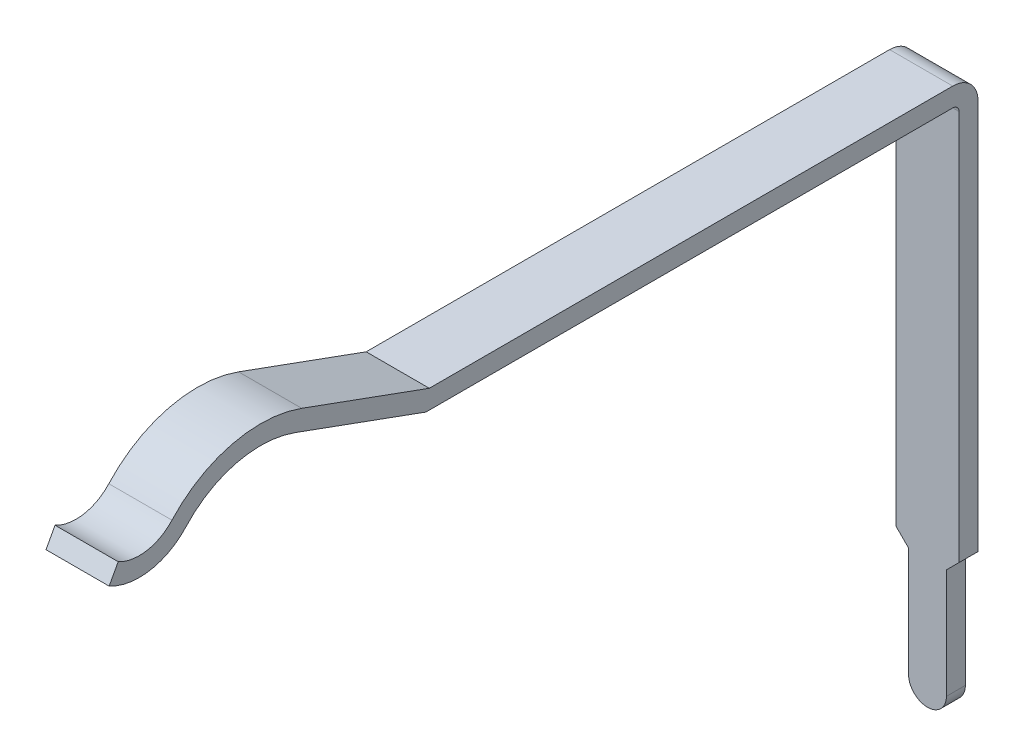
ISO-10303-21;
HEADER;
FILE_DESCRIPTION(('STEP AP214'),'2;1');
FILE_NAME('part.step','',(''),(''),'','','');
FILE_SCHEMA(('AUTOMOTIVE_DESIGN { 1 0 10303 214 1 1 1 1 }'));
ENDSEC;
DATA;
#1=APPLICATION_CONTEXT('core data for automotive mechanical design processes');
#2=APPLICATION_PROTOCOL_DEFINITION('international standard','automotive_design',2000,#1);
#3=PRODUCT_CONTEXT('',#1,'mechanical');
#4=PRODUCT('Part','Part','',(#3));
#5=PRODUCT_RELATED_PRODUCT_CATEGORY('part','',(#4));
#6=PRODUCT_DEFINITION_FORMATION('','',#4);
#7=PRODUCT_DEFINITION_CONTEXT('part definition',#1,'design');
#8=PRODUCT_DEFINITION('design','',#6,#7);
#9=PRODUCT_DEFINITION_SHAPE('','',#8);
#10=(LENGTH_UNIT() NAMED_UNIT(*) SI_UNIT(.MILLI.,.METRE.));
#11=(NAMED_UNIT(*) PLANE_ANGLE_UNIT() SI_UNIT($,.RADIAN.));
#12=(NAMED_UNIT(*) SI_UNIT($,.STERADIAN.) SOLID_ANGLE_UNIT());
#13=UNCERTAINTY_MEASURE_WITH_UNIT(LENGTH_MEASURE(1.E-05),#10,'distance_accuracy_value','');
#14=(GEOMETRIC_REPRESENTATION_CONTEXT(3) GLOBAL_UNCERTAINTY_ASSIGNED_CONTEXT((#13)) GLOBAL_UNIT_ASSIGNED_CONTEXT((#10,
#11,#12)) REPRESENTATION_CONTEXT('',''));
#15=CARTESIAN_POINT('',(0.,0.,0.));
#16=DIRECTION('',(0.,0.,1.));
#17=DIRECTION('',(1.,0.,0.));
#18=AXIS2_PLACEMENT_3D('',#15,#16,#17);
#19=CARTESIAN_POINT('',(0.5,-0.1,-14.46));
#20=DIRECTION('',(0.,0.,-1.));
#21=DIRECTION('',(-1.,0.,0.));
#22=AXIS2_PLACEMENT_3D('',#19,#20,#21);
#23=PLANE('',#22);
#24=DIRECTION('',(0.,1.,0.));
#25=VECTOR('',#24,1.);
#26=CARTESIAN_POINT('',(0.3,-0.1,-14.46));
#27=LINE('',#26,#25);
#28=CARTESIAN_POINT('',(0.3,-8.22,-14.46));
#29=VERTEX_POINT('',#28);
#30=CARTESIAN_POINT('',(0.3,-6.48526500902805,-14.46));
#31=VERTEX_POINT('',#30);
#32=EDGE_CURVE('E277',#29,#31,#27,.T.);
#33=ORIENTED_EDGE('',*,*,#32,.T.);
#34=DIRECTION('',(0.707106781186563,0.707106781186532,0.));
#35=VECTOR('',#34,1.);
#36=CARTESIAN_POINT('',(3.59263250451403,-3.19263250451416,-14.46));
#37=LINE('',#36,#35);
#38=CARTESIAN_POINT('',(0.5,-6.28526500902806,-14.46));
#39=VERTEX_POINT('',#38);
#40=EDGE_CURVE('E272',#31,#39,#37,.T.);
#41=ORIENTED_EDGE('',*,*,#40,.T.);
#42=DIRECTION('',(0.,-1.,0.));
#43=VECTOR('',#42,1.);
#44=CARTESIAN_POINT('',(0.5,-0.1,-14.46));
#45=LINE('',#44,#43);
#46=CARTESIAN_POINT('',(0.5,-0.1,-14.46));
#47=VERTEX_POINT('',#46);
#48=EDGE_CURVE('E200',#47,#39,#45,.T.);
#49=ORIENTED_EDGE('',*,*,#48,.F.);
#50=DIRECTION('',(-1.,0.,0.));
#51=VECTOR('',#50,1.);
#52=CARTESIAN_POINT('',(0.5,-0.1,-14.46));
#53=LINE('',#52,#51);
#54=CARTESIAN_POINT('',(-0.5,-0.1,-14.46));
#55=VERTEX_POINT('',#54);
#56=EDGE_CURVE('E163',#47,#55,#53,.T.);
#57=ORIENTED_EDGE('',*,*,#56,.T.);
#58=DIRECTION('',(0.,-1.,0.));
#59=VECTOR('',#58,1.);
#60=CARTESIAN_POINT('',(-0.5,-0.1,-14.46));
#61=LINE('',#60,#59);
#62=CARTESIAN_POINT('',(-0.5,-6.28526500902805,-14.46));
#63=VERTEX_POINT('',#62);
#64=EDGE_CURVE('E167',#55,#63,#61,.T.);
#65=ORIENTED_EDGE('',*,*,#64,.T.);
#66=DIRECTION('',(0.707106781186542,-0.707106781186553,0.));
#67=VECTOR('',#66,1.);
#68=CARTESIAN_POINT('',(-3.09263250451403,-3.69263250451398,-14.46));
#69=LINE('',#68,#67);
#70=CARTESIAN_POINT('',(-0.3,-6.48526500902805,-14.46));
#71=VERTEX_POINT('',#70);
#72=EDGE_CURVE('E49',#63,#71,#69,.T.);
#73=ORIENTED_EDGE('',*,*,#72,.T.);
#74=DIRECTION('',(0.,-1.,0.));
#75=VECTOR('',#74,1.);
#76=CARTESIAN_POINT('',(-0.3,-0.1,-14.46));
#77=LINE('',#76,#75);
#78=CARTESIAN_POINT('',(-0.3,-8.22,-14.46));
#79=VERTEX_POINT('',#78);
#80=EDGE_CURVE('E279',#71,#79,#77,.T.);
#81=ORIENTED_EDGE('',*,*,#80,.T.);
#82=CARTESIAN_POINT('',(0.,-8.22,-14.46));
#83=DIRECTION('',(0.,0.,-1.));
#84=DIRECTION('',(-1.,0.,0.));
#85=AXIS2_PLACEMENT_3D('',#82,#83,#84);
#86=CIRCLE('',#85,0.3);
#87=EDGE_CURVE('E171',#79,#29,#86,.F.);
#88=ORIENTED_EDGE('',*,*,#87,.T.);
#89=EDGE_LOOP('',(#33,#41,#49,#57,#65,#73,#81,#88));
#90=FACE_BOUND('',#89,.T.);
#91=ADVANCED_FACE('F35',(#90),#23,.F.);
#92=CARTESIAN_POINT('',(0.5,-0.1,-14.76));
#93=DIRECTION('',(0.,0.,-1.));
#94=DIRECTION('',(-1.,0.,0.));
#95=AXIS2_PLACEMENT_3D('',#92,#93,#94);
#96=PLANE('',#95);
#97=DIRECTION('',(-0.707106781186563,-0.707106781186532,0.));
#98=VECTOR('',#97,1.);
#99=CARTESIAN_POINT('',(0.5,-6.28526500902806,-14.76));
#100=LINE('',#99,#98);
#101=CARTESIAN_POINT('',(0.5,-6.28526500902806,-14.76));
#102=VERTEX_POINT('',#101);
#103=CARTESIAN_POINT('',(0.3,-6.48526500902805,-14.76));
#104=VERTEX_POINT('',#103);
#105=EDGE_CURVE('E303',#102,#104,#100,.T.);
#106=ORIENTED_EDGE('',*,*,#105,.T.);
#107=DIRECTION('',(0.,-1.,0.));
#108=VECTOR('',#107,1.);
#109=CARTESIAN_POINT('',(0.3,-6.48526500902805,-14.76));
#110=LINE('',#109,#108);
#111=CARTESIAN_POINT('',(0.3,-8.22,-14.76));
#112=VERTEX_POINT('',#111);
#113=EDGE_CURVE('E289',#104,#112,#110,.T.);
#114=ORIENTED_EDGE('',*,*,#113,.T.);
#115=CARTESIAN_POINT('',(0.,-8.22,-14.76));
#116=DIRECTION('',(0.,0.,-1.));
#117=DIRECTION('',(1.,0.,0.));
#118=AXIS2_PLACEMENT_3D('',#115,#116,#117);
#119=CIRCLE('',#118,0.3);
#120=CARTESIAN_POINT('',(-0.3,-8.22,-14.76));
#121=VERTEX_POINT('',#120);
#122=EDGE_CURVE('E312',#112,#121,#119,.T.);
#123=ORIENTED_EDGE('',*,*,#122,.T.);
#124=DIRECTION('',(0.,1.,0.));
#125=VECTOR('',#124,1.);
#126=CARTESIAN_POINT('',(-0.3,-8.22,-14.76));
#127=LINE('',#126,#125);
#128=CARTESIAN_POINT('',(-0.3,-6.48526500902805,-14.76));
#129=VERTEX_POINT('',#128);
#130=EDGE_CURVE('E309',#121,#129,#127,.T.);
#131=ORIENTED_EDGE('',*,*,#130,.T.);
#132=DIRECTION('',(-0.707106781186542,0.707106781186553,0.));
#133=VECTOR('',#132,1.);
#134=CARTESIAN_POINT('',(-0.3,-6.48526500902805,-14.76));
#135=LINE('',#134,#133);
#136=CARTESIAN_POINT('',(-0.5,-6.28526500902805,-14.76));
#137=VERTEX_POINT('',#136);
#138=EDGE_CURVE('E306',#129,#137,#135,.T.);
#139=ORIENTED_EDGE('',*,*,#138,.T.);
#140=DIRECTION('',(0.,1.,0.));
#141=VECTOR('',#140,1.);
#142=CARTESIAN_POINT('',(-0.5,-0.1,-14.76));
#143=LINE('',#142,#141);
#144=CARTESIAN_POINT('',(-0.5,-0.1,-14.76));
#145=VERTEX_POINT('',#144);
#146=EDGE_CURVE('E170',#145,#137,#143,.F.);
#147=ORIENTED_EDGE('',*,*,#146,.F.);
#148=DIRECTION('',(-1.,0.,0.));
#149=VECTOR('',#148,1.);
#150=CARTESIAN_POINT('',(0.5,-0.1,-14.76));
#151=LINE('',#150,#149);
#152=CARTESIAN_POINT('',(0.5,-0.1,-14.76));
#153=VERTEX_POINT('',#152);
#154=EDGE_CURVE('E11',#153,#145,#151,.T.);
#155=ORIENTED_EDGE('',*,*,#154,.F.);
#156=DIRECTION('',(0.,1.,0.));
#157=VECTOR('',#156,1.);
#158=CARTESIAN_POINT('',(0.5,-0.1,-14.76));
#159=LINE('',#158,#157);
#160=EDGE_CURVE('E242',#153,#102,#159,.F.);
#161=ORIENTED_EDGE('',*,*,#160,.T.);
#162=EDGE_LOOP('',(#106,#114,#123,#131,#139,#147,#155,#161));
#163=FACE_BOUND('',#162,.T.);
#164=ADVANCED_FACE('F316',(#163),#96,.T.);
#165=CARTESIAN_POINT('',(0.5,-0.1,-14.36));
#166=DIRECTION('',(-1.,0.,0.));
#167=DIRECTION('',(0.,0.,1.));
#168=AXIS2_PLACEMENT_3D('',#165,#166,#167);
#169=CYLINDRICAL_SURFACE('',#168,0.4);
#170=CARTESIAN_POINT('',(-0.5,-0.1,-14.36));
#171=DIRECTION('',(1.,0.,0.));
#172=DIRECTION('',(0.,0.,-1.));
#173=AXIS2_PLACEMENT_3D('',#170,#171,#172);
#174=CIRCLE('',#173,0.4);
#175=CARTESIAN_POINT('',(-0.5,0.3,-14.36));
#176=VERTEX_POINT('',#175);
#177=EDGE_CURVE('E174',#176,#145,#174,.F.);
#178=ORIENTED_EDGE('',*,*,#177,.F.);
#179=DIRECTION('',(-1.,0.,0.));
#180=VECTOR('',#179,1.);
#181=CARTESIAN_POINT('',(0.5,0.3,-14.36));
#182=LINE('',#181,#180);
#183=CARTESIAN_POINT('',(0.5,0.3,-14.36));
#184=VERTEX_POINT('',#183);
#185=EDGE_CURVE('E42',#184,#176,#182,.T.);
#186=ORIENTED_EDGE('',*,*,#185,.F.);
#187=CARTESIAN_POINT('',(0.5,-0.1,-14.36));
#188=DIRECTION('',(1.,0.,0.));
#189=DIRECTION('',(0.,0.,-1.));
#190=AXIS2_PLACEMENT_3D('',#187,#188,#189);
#191=CIRCLE('',#190,0.4);
#192=EDGE_CURVE('E238',#184,#153,#191,.F.);
#193=ORIENTED_EDGE('',*,*,#192,.T.);
#194=ORIENTED_EDGE('',*,*,#154,.T.);
#195=EDGE_LOOP('',(#178,#186,#193,#194));
#196=FACE_BOUND('',#195,.T.);
#197=ADVANCED_FACE('F226',(#196),#169,.T.);
#198=CARTESIAN_POINT('',(0.5,0.3,-6.01747897567001));
#199=DIRECTION('',(0.,1.,0.));
#200=DIRECTION('',(0.,0.,1.));
#201=AXIS2_PLACEMENT_3D('',#198,#199,#200);
#202=PLANE('',#201);
#203=DIRECTION('',(0.,0.,-1.));
#204=VECTOR('',#203,1.);
#205=CARTESIAN_POINT('',(-0.5,0.3,-6.01747897567001));
#206=LINE('',#205,#204);
#207=CARTESIAN_POINT('',(-0.5,0.3,-6.07037706988255));
#208=VERTEX_POINT('',#207);
#209=EDGE_CURVE('E177',#208,#176,#206,.T.);
#210=ORIENTED_EDGE('',*,*,#209,.F.);
#211=DIRECTION('',(-1.,0.,0.));
#212=VECTOR('',#211,1.);
#213=CARTESIAN_POINT('',(0.5,0.3,-6.07037706988255));
#214=LINE('',#213,#212);
#215=CARTESIAN_POINT('',(0.5,0.3,-6.07037706988255));
#216=VERTEX_POINT('',#215);
#217=EDGE_CURVE('E215',#216,#208,#214,.T.);
#218=ORIENTED_EDGE('',*,*,#217,.F.);
#219=DIRECTION('',(0.,0.,-1.));
#220=VECTOR('',#219,1.);
#221=CARTESIAN_POINT('',(0.5,0.3,-6.01747897567001));
#222=LINE('',#221,#220);
#223=EDGE_CURVE('E222',#216,#184,#222,.T.);
#224=ORIENTED_EDGE('',*,*,#223,.T.);
#225=ORIENTED_EDGE('',*,*,#185,.T.);
#226=EDGE_LOOP('',(#210,#218,#224,#225));
#227=FACE_BOUND('',#226,.T.);
#228=ADVANCED_FACE('F220',(#227),#202,.T.);
#229=CARTESIAN_POINT('',(0.5,1.03541597949323,-4.04983827231876));
#230=DIRECTION('',(0.,0.93969262078591,-0.342020143325664));
#231=DIRECTION('',(0.,0.342020143325664,0.93969262078591));
#232=AXIS2_PLACEMENT_3D('',#229,#230,#231);
#233=PLANE('',#232);
#234=DIRECTION('',(0.,-0.342020143325664,-0.93969262078591));
#235=VECTOR('',#234,1.);
#236=CARTESIAN_POINT('',(-0.5,1.03541597949323,-4.04983827231876));
#237=LINE('',#236,#235);
#238=CARTESIAN_POINT('',(-0.5,1.03541597949323,-4.04983827231876));
#239=VERTEX_POINT('',#238);
#240=EDGE_CURVE('E180',#239,#208,#237,.T.);
#241=ORIENTED_EDGE('',*,*,#240,.F.);
#242=DIRECTION('',(-1.,0.,0.));
#243=VECTOR('',#242,1.);
#244=CARTESIAN_POINT('',(0.5,1.03541597949323,-4.04983827231876));
#245=LINE('',#244,#243);
#246=CARTESIAN_POINT('',(0.5,1.03541597949323,-4.04983827231876));
#247=VERTEX_POINT('',#246);
#248=EDGE_CURVE('E213',#247,#239,#245,.T.);
#249=ORIENTED_EDGE('',*,*,#248,.F.);
#250=DIRECTION('',(0.,-0.342020143325664,-0.93969262078591));
#251=VECTOR('',#250,1.);
#252=CARTESIAN_POINT('',(0.5,1.03541597949323,-4.04983827231876));
#253=LINE('',#252,#251);
#254=EDGE_CURVE('E235',#247,#216,#253,.T.);
#255=ORIENTED_EDGE('',*,*,#254,.T.);
#256=ORIENTED_EDGE('',*,*,#217,.T.);
#257=EDGE_LOOP('',(#241,#249,#255,#256));
#258=FACE_BOUND('',#257,.T.);
#259=ADVANCED_FACE('F232',(#258),#233,.T.);
#260=CARTESIAN_POINT('',(0.5,-0.750000000000001,-3.4));
#261=DIRECTION('',(-1.,0.,0.));
#262=DIRECTION('',(0.,0.,1.));
#263=AXIS2_PLACEMENT_3D('',#260,#261,#262);
#264=CYLINDRICAL_SURFACE('',#263,1.9);
#265=CARTESIAN_POINT('',(-0.5,-0.750000000000001,-3.4));
#266=DIRECTION('',(1.,0.,0.));
#267=DIRECTION('',(0.,0.,-1.));
#268=AXIS2_PLACEMENT_3D('',#265,#266,#267);
#269=CIRCLE('',#268,1.9);
#270=CARTESIAN_POINT('',(-0.5,0.528846153846154,-1.99481228485554));
#271=VERTEX_POINT('',#270);
#272=EDGE_CURVE('E183',#271,#239,#269,.F.);
#273=ORIENTED_EDGE('',*,*,#272,.F.);
#274=DIRECTION('',(-1.,0.,0.));
#275=VECTOR('',#274,1.);
#276=CARTESIAN_POINT('',(0.5,0.528846153846154,-1.99481228485554));
#277=LINE('',#276,#275);
#278=CARTESIAN_POINT('',(0.5,0.528846153846154,-1.99481228485554));
#279=VERTEX_POINT('',#278);
#280=EDGE_CURVE('E211',#279,#271,#277,.T.);
#281=ORIENTED_EDGE('',*,*,#280,.F.);
#282=CARTESIAN_POINT('',(0.5,-0.750000000000001,-3.4));
#283=DIRECTION('',(1.,0.,0.));
#284=DIRECTION('',(0.,0.,-1.));
#285=AXIS2_PLACEMENT_3D('',#282,#283,#284);
#286=CIRCLE('',#285,1.9);
#287=EDGE_CURVE('E240',#279,#247,#286,.F.);
#288=ORIENTED_EDGE('',*,*,#287,.T.);
#289=ORIENTED_EDGE('',*,*,#248,.T.);
#290=EDGE_LOOP('',(#273,#281,#288,#289));
#291=FACE_BOUND('',#290,.T.);
#292=ADVANCED_FACE('F374',(#291),#264,.T.);
#293=CARTESIAN_POINT('',(0.5,1.,-1.47711154769706));
#294=DIRECTION('',(-1.,0.,0.));
#295=DIRECTION('',(0.,0.,1.));
#296=AXIS2_PLACEMENT_3D('',#293,#294,#295);
#297=CYLINDRICAL_SURFACE('',#296,0.7);
#298=CARTESIAN_POINT('',(-0.5,1.,-1.47711154769706));
#299=DIRECTION('',(1.,0.,0.));
#300=DIRECTION('',(0.,0.,-1.));
#301=AXIS2_PLACEMENT_3D('',#298,#299,#300);
#302=CIRCLE('',#301,0.7);
#303=CARTESIAN_POINT('',(-0.5,0.384810078255083,-1.14313346430912));
#304=VERTEX_POINT('',#303);
#305=EDGE_CURVE('E186',#304,#271,#302,.T.);
#306=ORIENTED_EDGE('',*,*,#305,.F.);
#307=DIRECTION('',(-1.,0.,0.));
#308=VECTOR('',#307,1.);
#309=CARTESIAN_POINT('',(0.5,0.384810078255083,-1.14313346430912));
#310=LINE('',#309,#308);
#311=CARTESIAN_POINT('',(0.5,0.384810078255083,-1.14313346430912));
#312=VERTEX_POINT('',#311);
#313=EDGE_CURVE('E209',#312,#304,#310,.T.);
#314=ORIENTED_EDGE('',*,*,#313,.F.);
#315=CARTESIAN_POINT('',(0.5,1.,-1.47711154769706));
#316=DIRECTION('',(1.,0.,0.));
#317=DIRECTION('',(0.,0.,-1.));
#318=AXIS2_PLACEMENT_3D('',#315,#316,#317);
#319=CIRCLE('',#318,0.7);
#320=EDGE_CURVE('E247',#312,#279,#319,.T.);
#321=ORIENTED_EDGE('',*,*,#320,.T.);
#322=ORIENTED_EDGE('',*,*,#280,.T.);
#323=EDGE_LOOP('',(#306,#314,#321,#322));
#324=FACE_BOUND('',#323,.T.);
#325=ADVANCED_FACE('F377',(#324),#297,.F.);
#326=CARTESIAN_POINT('',(0.5,0.121157254650118,-1.));
#327=DIRECTION('',(0.,0.477111547697058,0.878842745349882));
#328=DIRECTION('',(0.,-0.878842745349882,0.477111547697058));
#329=AXIS2_PLACEMENT_3D('',#326,#327,#328);
#330=PLANE('',#329);
#331=DIRECTION('',(0.,0.878842745349882,-0.477111547697058));
#332=VECTOR('',#331,1.);
#333=CARTESIAN_POINT('',(-0.5,0.121157254650118,-1.));
#334=LINE('',#333,#332);
#335=CARTESIAN_POINT('',(-0.5,0.121157254650118,-1.));
#336=VERTEX_POINT('',#335);
#337=EDGE_CURVE('E189',#336,#304,#334,.T.);
#338=ORIENTED_EDGE('',*,*,#337,.F.);
#339=DIRECTION('',(-1.,0.,0.));
#340=VECTOR('',#339,1.);
#341=CARTESIAN_POINT('',(0.5,0.121157254650118,-1.));
#342=LINE('',#341,#340);
#343=CARTESIAN_POINT('',(0.5,0.121157254650118,-1.));
#344=VERTEX_POINT('',#343);
#345=EDGE_CURVE('E207',#344,#336,#342,.T.);
#346=ORIENTED_EDGE('',*,*,#345,.F.);
#347=DIRECTION('',(0.,0.878842745349882,-0.477111547697058));
#348=VECTOR('',#347,1.);
#349=CARTESIAN_POINT('',(0.5,0.121157254650118,-1.));
#350=LINE('',#349,#348);
#351=EDGE_CURVE('E250',#344,#312,#350,.T.);
#352=ORIENTED_EDGE('',*,*,#351,.T.);
#353=ORIENTED_EDGE('',*,*,#313,.T.);
#354=EDGE_LOOP('',(#338,#346,#352,#353));
#355=FACE_BOUND('',#354,.T.);
#356=ADVANCED_FACE('F381',(#355),#330,.T.);
#357=CARTESIAN_POINT('',(0.5,1.,-1.47711154769706));
#358=DIRECTION('',(-1.,0.,0.));
#359=DIRECTION('',(0.,0.,1.));
#360=AXIS2_PLACEMENT_3D('',#357,#358,#359);
#361=CYLINDRICAL_SURFACE('',#360,1.);
#362=CARTESIAN_POINT('',(-0.5,1.,-1.47711154769706));
#363=DIRECTION('',(1.,0.,0.));
#364=DIRECTION('',(0.,0.,1.));
#365=AXIS2_PLACEMENT_3D('',#362,#363,#364);
#366=CIRCLE('',#365,1.);
#367=CARTESIAN_POINT('',(-0.5,0.326923076923077,-2.21668402935204));
#368=VERTEX_POINT('',#367);
#369=EDGE_CURVE('E192',#336,#368,#366,.T.);
#370=ORIENTED_EDGE('',*,*,#369,.T.);
#371=DIRECTION('',(-1.,0.,0.));
#372=VECTOR('',#371,1.);
#373=CARTESIAN_POINT('',(0.5,0.326923076923077,-2.21668402935204));
#374=LINE('',#373,#372);
#375=CARTESIAN_POINT('',(0.5,0.326923076923077,-2.21668402935204));
#376=VERTEX_POINT('',#375);
#377=EDGE_CURVE('E204',#376,#368,#374,.T.);
#378=ORIENTED_EDGE('',*,*,#377,.F.);
#379=CARTESIAN_POINT('',(0.5,1.,-1.47711154769706));
#380=DIRECTION('',(1.,0.,0.));
#381=DIRECTION('',(0.,0.,1.));
#382=AXIS2_PLACEMENT_3D('',#379,#380,#381);
#383=CIRCLE('',#382,1.);
#384=EDGE_CURVE('E253',#344,#376,#383,.T.);
#385=ORIENTED_EDGE('',*,*,#384,.F.);
#386=ORIENTED_EDGE('',*,*,#345,.T.);
#387=EDGE_LOOP('',(#370,#378,#385,#386));
#388=FACE_BOUND('',#387,.T.);
#389=ADVANCED_FACE('F259',(#388),#361,.T.);
#390=CARTESIAN_POINT('',(0.5,-0.750000000000001,-3.4));
#391=DIRECTION('',(-1.,0.,0.));
#392=DIRECTION('',(0.,0.,1.));
#393=AXIS2_PLACEMENT_3D('',#390,#391,#392);
#394=CYLINDRICAL_SURFACE('',#393,1.6);
#395=CARTESIAN_POINT('',(-0.5,-0.750000000000001,-3.4));
#396=DIRECTION('',(-1.,0.,0.));
#397=DIRECTION('',(0.,0.,-1.));
#398=AXIS2_PLACEMENT_3D('',#395,#396,#397);
#399=CIRCLE('',#398,1.6);
#400=CARTESIAN_POINT('',(-0.5,0.753508193257457,-3.94723222932106));
#401=VERTEX_POINT('',#400);
#402=EDGE_CURVE('E194',#368,#401,#399,.T.);
#403=ORIENTED_EDGE('',*,*,#402,.T.);
#404=DIRECTION('',(-1.,0.,0.));
#405=VECTOR('',#404,1.);
#406=CARTESIAN_POINT('',(0.5,0.753508193257457,-3.94723222932106));
#407=LINE('',#406,#405);
#408=CARTESIAN_POINT('',(0.5,0.753508193257457,-3.94723222932106));
#409=VERTEX_POINT('',#408);
#410=EDGE_CURVE('E158',#409,#401,#407,.T.);
#411=ORIENTED_EDGE('',*,*,#410,.F.);
#412=CARTESIAN_POINT('',(0.5,-0.750000000000001,-3.4));
#413=DIRECTION('',(-1.,0.,0.));
#414=DIRECTION('',(0.,0.,-1.));
#415=AXIS2_PLACEMENT_3D('',#412,#413,#414);
#416=CIRCLE('',#415,1.6);
#417=EDGE_CURVE('E146',#376,#409,#416,.T.);
#418=ORIENTED_EDGE('',*,*,#417,.F.);
#419=ORIENTED_EDGE('',*,*,#377,.T.);
#420=EDGE_LOOP('',(#403,#411,#418,#419));
#421=FACE_BOUND('',#420,.T.);
#422=ADVANCED_FACE('F263',(#421),#394,.F.);
#423=CARTESIAN_POINT('',(0.5,0.753508193257457,-3.94723222932106));
#424=DIRECTION('',(0.,0.93969262078591,-0.342020143325664));
#425=DIRECTION('',(0.,0.342020143325664,0.93969262078591));
#426=AXIS2_PLACEMENT_3D('',#423,#424,#425);
#427=PLANE('',#426);
#428=DIRECTION('',(0.,-0.342020143325664,-0.93969262078591));
#429=VECTOR('',#428,1.);
#430=CARTESIAN_POINT('',(-0.5,0.753508193257457,-3.94723222932106));
#431=LINE('',#430,#429);
#432=CARTESIAN_POINT('',(-0.5,0.,-6.01747897567001));
#433=VERTEX_POINT('',#432);
#434=EDGE_CURVE('E155',#401,#433,#431,.T.);
#435=ORIENTED_EDGE('',*,*,#434,.T.);
#436=DIRECTION('',(-1.,0.,0.));
#437=VECTOR('',#436,1.);
#438=CARTESIAN_POINT('',(0.5,0.,-6.01747897567001));
#439=LINE('',#438,#437);
#440=CARTESIAN_POINT('',(0.5,0.,-6.01747897567001));
#441=VERTEX_POINT('',#440);
#442=EDGE_CURVE('E152',#441,#433,#439,.T.);
#443=ORIENTED_EDGE('',*,*,#442,.F.);
#444=DIRECTION('',(0.,-0.342020143325664,-0.93969262078591));
#445=VECTOR('',#444,1.);
#446=CARTESIAN_POINT('',(0.5,0.753508193257457,-3.94723222932106));
#447=LINE('',#446,#445);
#448=EDGE_CURVE('E138',#409,#441,#447,.T.);
#449=ORIENTED_EDGE('',*,*,#448,.F.);
#450=ORIENTED_EDGE('',*,*,#410,.T.);
#451=EDGE_LOOP('',(#435,#443,#449,#450));
#452=FACE_BOUND('',#451,.T.);
#453=ADVANCED_FACE('F153',(#452),#427,.F.);
#454=CARTESIAN_POINT('',(0.5,0.,-6.01747897567001));
#455=DIRECTION('',(0.,1.,0.));
#456=DIRECTION('',(0.,0.,1.));
#457=AXIS2_PLACEMENT_3D('',#454,#455,#456);
#458=PLANE('',#457);
#459=DIRECTION('',(0.,0.,-1.));
#460=VECTOR('',#459,1.);
#461=CARTESIAN_POINT('',(-0.5,0.,-6.01747897567001));
#462=LINE('',#461,#460);
#463=CARTESIAN_POINT('',(-0.5,0.,-14.36));
#464=VERTEX_POINT('',#463);
#465=EDGE_CURVE('E197',#433,#464,#462,.T.);
#466=ORIENTED_EDGE('',*,*,#465,.T.);
#467=DIRECTION('',(-1.,0.,0.));
#468=VECTOR('',#467,1.);
#469=CARTESIAN_POINT('',(0.5,0.,-14.36));
#470=LINE('',#469,#468);
#471=CARTESIAN_POINT('',(0.5,0.,-14.36));
#472=VERTEX_POINT('',#471);
#473=EDGE_CURVE('E159',#472,#464,#470,.T.);
#474=ORIENTED_EDGE('',*,*,#473,.F.);
#475=DIRECTION('',(0.,0.,-1.));
#476=VECTOR('',#475,1.);
#477=CARTESIAN_POINT('',(0.5,0.,-6.01747897567001));
#478=LINE('',#477,#476);
#479=EDGE_CURVE('E143',#441,#472,#478,.T.);
#480=ORIENTED_EDGE('',*,*,#479,.F.);
#481=ORIENTED_EDGE('',*,*,#442,.T.);
#482=EDGE_LOOP('',(#466,#474,#480,#481));
#483=FACE_BOUND('',#482,.T.);
#484=ADVANCED_FACE('F161',(#483),#458,.F.);
#485=CARTESIAN_POINT('',(0.5,-0.1,-14.36));
#486=DIRECTION('',(-1.,0.,0.));
#487=DIRECTION('',(0.,0.,1.));
#488=AXIS2_PLACEMENT_3D('',#485,#486,#487);
#489=CYLINDRICAL_SURFACE('',#488,0.0999999999999997);
#490=CARTESIAN_POINT('',(-0.5,-0.1,-14.36));
#491=DIRECTION('',(-1.,0.,0.));
#492=DIRECTION('',(0.,0.,1.));
#493=AXIS2_PLACEMENT_3D('',#490,#491,#492);
#494=CIRCLE('',#493,0.0999999999999997);
#495=EDGE_CURVE('E102',#464,#55,#494,.T.);
#496=ORIENTED_EDGE('',*,*,#495,.T.);
#497=ORIENTED_EDGE('',*,*,#56,.F.);
#498=CARTESIAN_POINT('',(0.5,-0.1,-14.36));
#499=DIRECTION('',(-1.,0.,0.));
#500=DIRECTION('',(0.,0.,1.));
#501=AXIS2_PLACEMENT_3D('',#498,#499,#500);
#502=CIRCLE('',#501,0.0999999999999997);
#503=EDGE_CURVE('E58',#472,#47,#502,.T.);
#504=ORIENTED_EDGE('',*,*,#503,.F.);
#505=ORIENTED_EDGE('',*,*,#473,.T.);
#506=EDGE_LOOP('',(#496,#497,#504,#505));
#507=FACE_BOUND('',#506,.T.);
#508=ADVANCED_FACE('F265',(#507),#489,.F.);
#509=CARTESIAN_POINT('',(0.5,-0.1,-14.36));
#510=DIRECTION('',(1.,0.,0.));
#511=DIRECTION('',(0.,0.,-1.));
#512=AXIS2_PLACEMENT_3D('',#509,#510,#511);
#513=PLANE('',#512);
#514=DIRECTION('',(0.,0.,1.));
#515=VECTOR('',#514,1.);
#516=CARTESIAN_POINT('',(0.5,-6.28526500902806,-14.76));
#517=LINE('',#516,#515);
#518=EDGE_CURVE('E293',#102,#39,#517,.T.);
#519=ORIENTED_EDGE('',*,*,#518,.F.);
#520=ORIENTED_EDGE('',*,*,#160,.F.);
#521=ORIENTED_EDGE('',*,*,#192,.F.);
#522=ORIENTED_EDGE('',*,*,#223,.F.);
#523=ORIENTED_EDGE('',*,*,#254,.F.);
#524=ORIENTED_EDGE('',*,*,#287,.F.);
#525=ORIENTED_EDGE('',*,*,#320,.F.);
#526=ORIENTED_EDGE('',*,*,#351,.F.);
#527=ORIENTED_EDGE('',*,*,#384,.T.);
#528=ORIENTED_EDGE('',*,*,#417,.T.);
#529=ORIENTED_EDGE('',*,*,#448,.T.);
#530=ORIENTED_EDGE('',*,*,#479,.T.);
#531=ORIENTED_EDGE('',*,*,#503,.T.);
#532=ORIENTED_EDGE('',*,*,#48,.T.);
#533=EDGE_LOOP('',(#519,#520,#521,#522,#523,#524,#525,#526,#527,#528,#529,#530,#531,#532));
#534=FACE_BOUND('',#533,.T.);
#535=ADVANCED_FACE('F141',(#534),#513,.T.);
#536=CARTESIAN_POINT('',(-0.5,-0.1,-14.36));
#537=DIRECTION('',(1.,0.,0.));
#538=DIRECTION('',(0.,0.,-1.));
#539=AXIS2_PLACEMENT_3D('',#536,#537,#538);
#540=PLANE('',#539);
#541=ORIENTED_EDGE('',*,*,#146,.T.);
#542=DIRECTION('',(0.,0.,1.));
#543=VECTOR('',#542,1.);
#544=CARTESIAN_POINT('',(-0.5,-6.28526500902805,-14.76));
#545=LINE('',#544,#543);
#546=EDGE_CURVE('E291',#137,#63,#545,.T.);
#547=ORIENTED_EDGE('',*,*,#546,.T.);
#548=ORIENTED_EDGE('',*,*,#64,.F.);
#549=ORIENTED_EDGE('',*,*,#495,.F.);
#550=ORIENTED_EDGE('',*,*,#465,.F.);
#551=ORIENTED_EDGE('',*,*,#434,.F.);
#552=ORIENTED_EDGE('',*,*,#402,.F.);
#553=ORIENTED_EDGE('',*,*,#369,.F.);
#554=ORIENTED_EDGE('',*,*,#337,.T.);
#555=ORIENTED_EDGE('',*,*,#305,.T.);
#556=ORIENTED_EDGE('',*,*,#272,.T.);
#557=ORIENTED_EDGE('',*,*,#240,.T.);
#558=ORIENTED_EDGE('',*,*,#209,.T.);
#559=ORIENTED_EDGE('',*,*,#177,.T.);
#560=EDGE_LOOP('',(#541,#547,#548,#549,#550,#551,#552,#553,#554,#555,#556,#557,#558,#559));
#561=FACE_BOUND('',#560,.T.);
#562=ADVANCED_FACE('F228',(#561),#540,.F.);
#563=CARTESIAN_POINT('',(0.,-8.22,-14.76));
#564=DIRECTION('',(0.,0.,1.));
#565=DIRECTION('',(1.,0.,0.));
#566=AXIS2_PLACEMENT_3D('',#563,#564,#565);
#567=CYLINDRICAL_SURFACE('',#566,0.3);
#568=DIRECTION('',(0.,0.,1.));
#569=VECTOR('',#568,1.);
#570=CARTESIAN_POINT('',(-0.3,-8.22,-14.76));
#571=LINE('',#570,#569);
#572=EDGE_CURVE('E285',#121,#79,#571,.T.);
#573=ORIENTED_EDGE('',*,*,#572,.F.);
#574=ORIENTED_EDGE('',*,*,#122,.F.);
#575=DIRECTION('',(0.,0.,1.));
#576=VECTOR('',#575,1.);
#577=CARTESIAN_POINT('',(0.3,-8.22,-14.76));
#578=LINE('',#577,#576);
#579=EDGE_CURVE('E284',#112,#29,#578,.T.);
#580=ORIENTED_EDGE('',*,*,#579,.T.);
#581=ORIENTED_EDGE('',*,*,#87,.F.);
#582=EDGE_LOOP('',(#573,#574,#580,#581));
#583=FACE_BOUND('',#582,.T.);
#584=ADVANCED_FACE('F325',(#583),#567,.T.);
#585=CARTESIAN_POINT('',(0.3,-6.48526500902805,-14.76));
#586=DIRECTION('',(-1.,0.,0.));
#587=DIRECTION('',(0.,-1.,0.));
#588=AXIS2_PLACEMENT_3D('',#585,#586,#587);
#589=PLANE('',#588);
#590=ORIENTED_EDGE('',*,*,#579,.F.);
#591=ORIENTED_EDGE('',*,*,#113,.F.);
#592=DIRECTION('',(0.,0.,1.));
#593=VECTOR('',#592,1.);
#594=CARTESIAN_POINT('',(0.3,-6.48526500902805,-14.76));
#595=LINE('',#594,#593);
#596=EDGE_CURVE('E296',#104,#31,#595,.T.);
#597=ORIENTED_EDGE('',*,*,#596,.T.);
#598=ORIENTED_EDGE('',*,*,#32,.F.);
#599=EDGE_LOOP('',(#590,#591,#597,#598));
#600=FACE_BOUND('',#599,.T.);
#601=ADVANCED_FACE('F332',(#600),#589,.F.);
#602=CARTESIAN_POINT('',(-0.3,-8.22,-14.76));
#603=DIRECTION('',(1.,0.,0.));
#604=DIRECTION('',(0.,0.,-1.));
#605=AXIS2_PLACEMENT_3D('',#602,#603,#604);
#606=PLANE('',#605);
#607=DIRECTION('',(0.,0.,1.));
#608=VECTOR('',#607,1.);
#609=CARTESIAN_POINT('',(-0.3,-6.48526500902805,-14.76));
#610=LINE('',#609,#608);
#611=EDGE_CURVE('E288',#129,#71,#610,.T.);
#612=ORIENTED_EDGE('',*,*,#611,.F.);
#613=ORIENTED_EDGE('',*,*,#130,.F.);
#614=ORIENTED_EDGE('',*,*,#572,.T.);
#615=ORIENTED_EDGE('',*,*,#80,.F.);
#616=EDGE_LOOP('',(#612,#613,#614,#615));
#617=FACE_BOUND('',#616,.T.);
#618=ADVANCED_FACE('F351',(#617),#606,.F.);
#619=CARTESIAN_POINT('',(0.5,-6.28526500902806,-14.76));
#620=DIRECTION('',(-0.707106781186532,0.707106781186563,0.));
#621=DIRECTION('',(-0.707106781186563,-0.707106781186532,0.));
#622=AXIS2_PLACEMENT_3D('',#619,#620,#621);
#623=PLANE('',#622);
#624=ORIENTED_EDGE('',*,*,#596,.F.);
#625=ORIENTED_EDGE('',*,*,#105,.F.);
#626=ORIENTED_EDGE('',*,*,#518,.T.);
#627=ORIENTED_EDGE('',*,*,#40,.F.);
#628=EDGE_LOOP('',(#624,#625,#626,#627));
#629=FACE_BOUND('',#628,.T.);
#630=ADVANCED_FACE('F354',(#629),#623,.F.);
#631=CARTESIAN_POINT('',(-0.3,-6.48526500902805,-14.76));
#632=DIRECTION('',(0.707106781186553,0.707106781186542,0.));
#633=DIRECTION('',(-0.707106781186542,0.707106781186553,0.));
#634=AXIS2_PLACEMENT_3D('',#631,#632,#633);
#635=PLANE('',#634);
#636=ORIENTED_EDGE('',*,*,#546,.F.);
#637=ORIENTED_EDGE('',*,*,#138,.F.);
#638=ORIENTED_EDGE('',*,*,#611,.T.);
#639=ORIENTED_EDGE('',*,*,#72,.F.);
#640=EDGE_LOOP('',(#636,#637,#638,#639));
#641=FACE_BOUND('',#640,.T.);
#642=ADVANCED_FACE('F352',(#641),#635,.F.);
#643=CLOSED_SHELL('',(#91,#164,#197,#228,#259,#292,#325,#356,#389,#422,#453,#484,#508,#535,#562,
#584,#601,#618,#630,#642));
#644=MANIFOLD_SOLID_BREP('B2',#643);
#645=ADVANCED_BREP_SHAPE_REPRESENTATION('',(#18,#644),#14);
#646=SHAPE_DEFINITION_REPRESENTATION(#9,#645);
ENDSEC;
END-ISO-10303-21;
